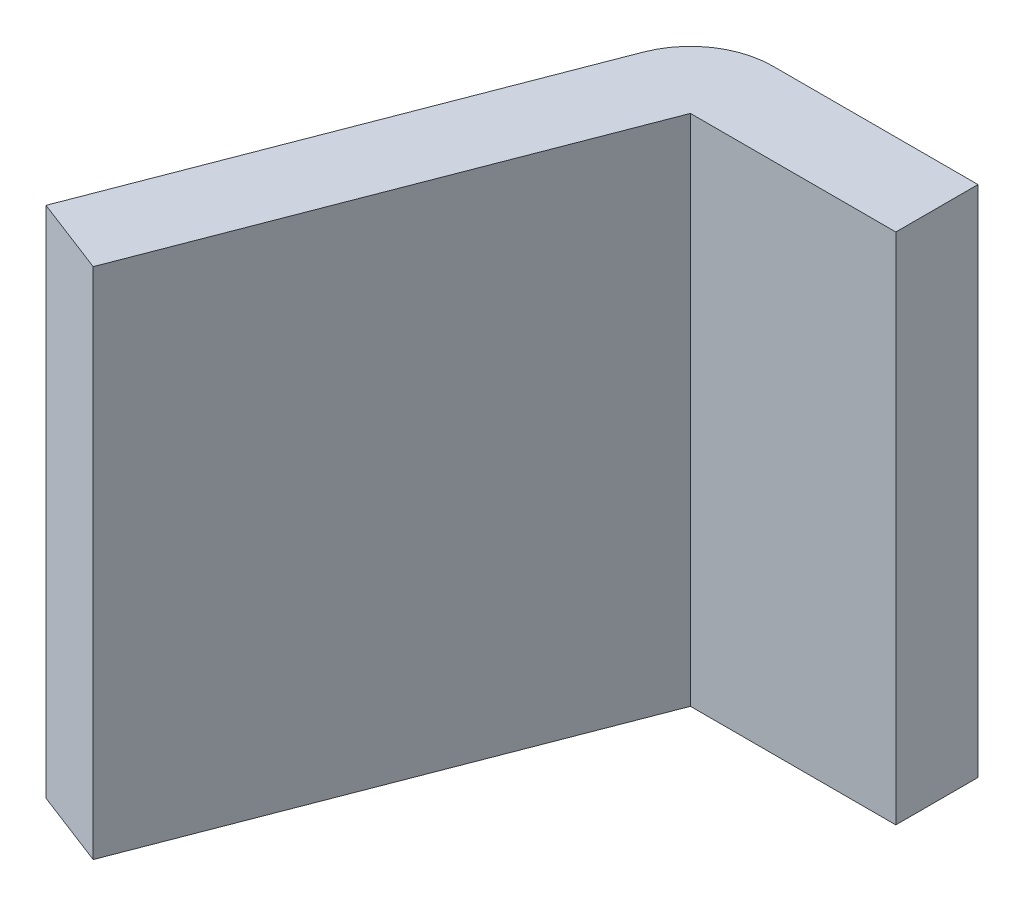
ISO-10303-21;
HEADER;
FILE_DESCRIPTION(('STEP AP214'),'2;1');
FILE_NAME('part.step','',(''),(''),'','','');
FILE_SCHEMA(('AUTOMOTIVE_DESIGN { 1 0 10303 214 1 1 1 1 }'));
ENDSEC;
DATA;
#1=APPLICATION_CONTEXT('core data for automotive mechanical design processes');
#2=APPLICATION_PROTOCOL_DEFINITION('international standard','automotive_design',2000,#1);
#3=PRODUCT_CONTEXT('',#1,'mechanical');
#4=PRODUCT('Part','Part','',(#3));
#5=PRODUCT_RELATED_PRODUCT_CATEGORY('part','',(#4));
#6=PRODUCT_DEFINITION_FORMATION('','',#4);
#7=PRODUCT_DEFINITION_CONTEXT('part definition',#1,'design');
#8=PRODUCT_DEFINITION('design','',#6,#7);
#9=PRODUCT_DEFINITION_SHAPE('','',#8);
#10=(LENGTH_UNIT() NAMED_UNIT(*) SI_UNIT(.MILLI.,.METRE.));
#11=(NAMED_UNIT(*) PLANE_ANGLE_UNIT() SI_UNIT($,.RADIAN.));
#12=(NAMED_UNIT(*) SI_UNIT($,.STERADIAN.) SOLID_ANGLE_UNIT());
#13=UNCERTAINTY_MEASURE_WITH_UNIT(LENGTH_MEASURE(1.E-05),#10,'distance_accuracy_value','');
#14=(GEOMETRIC_REPRESENTATION_CONTEXT(3) GLOBAL_UNCERTAINTY_ASSIGNED_CONTEXT((#13)) GLOBAL_UNIT_ASSIGNED_CONTEXT((#10,
#11,#12)) REPRESENTATION_CONTEXT('',''));
#15=CARTESIAN_POINT('',(0.,0.,0.));
#16=DIRECTION('',(0.,0.,1.));
#17=DIRECTION('',(1.,0.,0.));
#18=AXIS2_PLACEMENT_3D('',#15,#16,#17);
#19=CARTESIAN_POINT('',(-1.8,0.5,0.));
#20=DIRECTION('',(1.,0.,0.));
#21=DIRECTION('',(0.,0.,-1.));
#22=AXIS2_PLACEMENT_3D('',#19,#20,#21);
#23=PLANE('',#22);
#24=DIRECTION('',(0.,0.,-1.));
#25=VECTOR('',#24,1.);
#26=CARTESIAN_POINT('',(-1.8,0.5,0.0800000000000071));
#27=LINE('',#26,#25);
#28=CARTESIAN_POINT('',(-1.8,0.5,0.));
#29=VERTEX_POINT('',#28);
#30=CARTESIAN_POINT('',(-1.8,0.5,0.0800000000000071));
#31=VERTEX_POINT('',#30);
#32=EDGE_CURVE('E82',#29,#31,#27,.F.);
#33=ORIENTED_EDGE('',*,*,#32,.T.);
#34=DIRECTION('',(0.,1.,0.));
#35=VECTOR('',#34,1.);
#36=CARTESIAN_POINT('',(-1.8,0.5,0.0800000000000071));
#37=LINE('',#36,#35);
#38=CARTESIAN_POINT('',(-1.8,0.,0.0800000000000071));
#39=VERTEX_POINT('',#38);
#40=EDGE_CURVE('E85',#39,#31,#37,.T.);
#41=ORIENTED_EDGE('',*,*,#40,.F.);
#42=DIRECTION('',(0.,0.,-1.));
#43=VECTOR('',#42,1.);
#44=CARTESIAN_POINT('',(-1.8,0.,0.0800000000000071));
#45=LINE('',#44,#43);
#46=CARTESIAN_POINT('',(-1.8,0.,0.));
#47=VERTEX_POINT('',#46);
#48=EDGE_CURVE('E124',#47,#39,#45,.F.);
#49=ORIENTED_EDGE('',*,*,#48,.F.);
#50=DIRECTION('',(0.,1.,0.));
#51=VECTOR('',#50,1.);
#52=CARTESIAN_POINT('',(-1.8,0.5,0.));
#53=LINE('',#52,#51);
#54=EDGE_CURVE('E87',#29,#47,#53,.F.);
#55=ORIENTED_EDGE('',*,*,#54,.F.);
#56=EDGE_LOOP('',(#33,#41,#49,#55));
#57=FACE_BOUND('',#56,.T.);
#58=ADVANCED_FACE('F16',(#57),#23,.T.);
#59=CARTESIAN_POINT('',(-1.8,0.5,0.0800000000000071));
#60=DIRECTION('',(0.,0.,1.));
#61=DIRECTION('',(1.,0.,0.));
#62=AXIS2_PLACEMENT_3D('',#59,#60,#61);
#63=PLANE('',#62);
#64=DIRECTION('',(1.,0.,0.));
#65=VECTOR('',#64,1.);
#66=CARTESIAN_POINT('',(-2.,0.5,0.0800000000000071));
#67=LINE('',#66,#65);
#68=CARTESIAN_POINT('',(-2.00000000000041,0.5,0.0800000000000071));
#69=VERTEX_POINT('',#68);
#70=EDGE_CURVE('E90',#31,#69,#67,.F.);
#71=ORIENTED_EDGE('',*,*,#70,.T.);
#72=DIRECTION('',(0.,1.,0.));
#73=VECTOR('',#72,1.);
#74=CARTESIAN_POINT('',(-2.00000000000041,0.5,0.0800000000000071));
#75=LINE('',#74,#73);
#76=CARTESIAN_POINT('',(-2.00000000000041,0.,0.0800000000000071));
#77=VERTEX_POINT('',#76);
#78=EDGE_CURVE('E98',#77,#69,#75,.T.);
#79=ORIENTED_EDGE('',*,*,#78,.F.);
#80=DIRECTION('',(1.,0.,0.));
#81=VECTOR('',#80,1.);
#82=CARTESIAN_POINT('',(-2.,0.,0.0800000000000071));
#83=LINE('',#82,#81);
#84=EDGE_CURVE('E96',#39,#77,#83,.F.);
#85=ORIENTED_EDGE('',*,*,#84,.F.);
#86=ORIENTED_EDGE('',*,*,#40,.T.);
#87=EDGE_LOOP('',(#71,#79,#85,#86));
#88=FACE_BOUND('',#87,.T.);
#89=ADVANCED_FACE('F94',(#88),#63,.T.);
#90=CARTESIAN_POINT('',(-2.00000000000041,0.5,0.0800000000000071));
#91=DIRECTION('',(0.933333333347552,0.,0.359010987105336));
#92=DIRECTION('',(0.359010987105336,0.,-0.933333333347552));
#93=AXIS2_PLACEMENT_3D('',#90,#91,#92);
#94=PLANE('',#93);
#95=DIRECTION('',(-0.359010987105336,0.,0.933333333347552));
#96=VECTOR('',#95,1.);
#97=CARTESIAN_POINT('',(-2.00000000000041,0.5,0.0800000000000071));
#98=LINE('',#97,#96);
#99=CARTESIAN_POINT('',(-2.16155494419535,0.5,0.500000000000007));
#100=VERTEX_POINT('',#99);
#101=EDGE_CURVE('E60',#69,#100,#98,.T.);
#102=ORIENTED_EDGE('',*,*,#101,.T.);
#103=DIRECTION('',(0.,1.,0.));
#104=VECTOR('',#103,1.);
#105=CARTESIAN_POINT('',(-2.16155494419535,0.5,0.500000000000007));
#106=LINE('',#105,#104);
#107=CARTESIAN_POINT('',(-2.16155494419535,0.,0.500000000000007));
#108=VERTEX_POINT('',#107);
#109=EDGE_CURVE('E151',#108,#100,#106,.T.);
#110=ORIENTED_EDGE('',*,*,#109,.F.);
#111=DIRECTION('',(-0.359010987105336,0.,0.933333333347552));
#112=VECTOR('',#111,1.);
#113=CARTESIAN_POINT('',(-2.00000000000041,0.,0.0800000000000071));
#114=LINE('',#113,#112);
#115=EDGE_CURVE('E118',#77,#108,#114,.T.);
#116=ORIENTED_EDGE('',*,*,#115,.F.);
#117=ORIENTED_EDGE('',*,*,#78,.T.);
#118=EDGE_LOOP('',(#102,#110,#116,#117));
#119=FACE_BOUND('',#118,.T.);
#120=ADVANCED_FACE('F166',(#119),#94,.T.);
#121=CARTESIAN_POINT('',(-2.,0.5,0.));
#122=DIRECTION('',(0.,0.,-1.));
#123=DIRECTION('',(-1.,0.,0.));
#124=AXIS2_PLACEMENT_3D('',#121,#122,#123);
#125=PLANE('',#124);
#126=DIRECTION('',(1.,0.,0.));
#127=VECTOR('',#126,1.);
#128=CARTESIAN_POINT('',(-2.,0.5,0.));
#129=LINE('',#128,#127);
#130=CARTESIAN_POINT('',(-2.,0.5,0.));
#131=VERTEX_POINT('',#130);
#132=EDGE_CURVE('E91',#131,#29,#129,.T.);
#133=ORIENTED_EDGE('',*,*,#132,.T.);
#134=ORIENTED_EDGE('',*,*,#54,.T.);
#135=DIRECTION('',(1.,0.,0.));
#136=VECTOR('',#135,1.);
#137=CARTESIAN_POINT('',(-2.,0.,0.));
#138=LINE('',#137,#136);
#139=CARTESIAN_POINT('',(-2.,0.,0.));
#140=VERTEX_POINT('',#139);
#141=EDGE_CURVE('E51',#140,#47,#138,.T.);
#142=ORIENTED_EDGE('',*,*,#141,.F.);
#143=DIRECTION('',(0.,1.,0.));
#144=VECTOR('',#143,1.);
#145=CARTESIAN_POINT('',(-2.,0.5,0.));
#146=LINE('',#145,#144);
#147=EDGE_CURVE('E129',#131,#140,#146,.F.);
#148=ORIENTED_EDGE('',*,*,#147,.F.);
#149=EDGE_LOOP('',(#133,#134,#142,#148));
#150=FACE_BOUND('',#149,.T.);
#151=ADVANCED_FACE('F171',(#150),#125,.T.);
#152=CARTESIAN_POINT('',(-2.,0.,0.0800000000000071));
#153=DIRECTION('',(0.,-1.,0.));
#154=DIRECTION('',(0.,0.,-1.));
#155=AXIS2_PLACEMENT_3D('',#152,#153,#154);
#156=PLANE('',#155);
#157=DIRECTION('',(0.933333333347547,0.,0.359010987105349));
#158=VECTOR('',#157,1.);
#159=CARTESIAN_POINT('',(-2.16155494419535,0.,0.500000000000007));
#160=LINE('',#159,#158);
#161=CARTESIAN_POINT('',(-2.23622161086346,0.,0.471279121031461));
#162=VERTEX_POINT('',#161);
#163=EDGE_CURVE('E120',#162,#108,#160,.T.);
#164=ORIENTED_EDGE('',*,*,#163,.F.);
#165=DIRECTION('',(-0.359010987105348,0.,0.933333333347547));
#166=VECTOR('',#165,1.);
#167=CARTESIAN_POINT('',(-2.23622161086346,0.,0.471279121031461));
#168=LINE('',#167,#166);
#169=CARTESIAN_POINT('',(-2.07466666666849,0.,0.0512791210313932));
#170=VERTEX_POINT('',#169);
#171=EDGE_CURVE('E132',#170,#162,#168,.T.);
#172=ORIENTED_EDGE('',*,*,#171,.F.);
#173=CARTESIAN_POINT('',(-2.,0.,0.0800000000000071));
#174=DIRECTION('',(0.,1.,0.));
#175=DIRECTION('',(0.,0.,1.));
#176=AXIS2_PLACEMENT_3D('',#173,#174,#175);
#177=CIRCLE('',#176,0.0800000000000071);
#178=EDGE_CURVE('E19',#140,#170,#177,.T.);
#179=ORIENTED_EDGE('',*,*,#178,.F.);
#180=ORIENTED_EDGE('',*,*,#141,.T.);
#181=ORIENTED_EDGE('',*,*,#48,.T.);
#182=ORIENTED_EDGE('',*,*,#84,.T.);
#183=ORIENTED_EDGE('',*,*,#115,.T.);
#184=EDGE_LOOP('',(#164,#172,#179,#180,#181,#182,#183));
#185=FACE_BOUND('',#184,.T.);
#186=ADVANCED_FACE('F168',(#185),#156,.T.);
#187=CARTESIAN_POINT('',(-2.16155494419535,0.5,0.500000000000007));
#188=DIRECTION('',(-0.359010987105349,0.,0.933333333347547));
#189=DIRECTION('',(0.933333333347547,0.,0.359010987105349));
#190=AXIS2_PLACEMENT_3D('',#187,#188,#189);
#191=PLANE('',#190);
#192=DIRECTION('',(-0.933333333347545,0.,-0.359010987105353));
#193=VECTOR('',#192,1.);
#194=CARTESIAN_POINT('',(-2.16155494419535,0.5,0.500000000000007));
#195=LINE('',#194,#193);
#196=CARTESIAN_POINT('',(-2.23622161086346,0.5,0.471279121031461));
#197=VERTEX_POINT('',#196);
#198=EDGE_CURVE('E103',#100,#197,#195,.T.);
#199=ORIENTED_EDGE('',*,*,#198,.T.);
#200=DIRECTION('',(0.,1.,0.));
#201=VECTOR('',#200,1.);
#202=CARTESIAN_POINT('',(-2.23622161086346,0.5,0.471279121031461));
#203=LINE('',#202,#201);
#204=EDGE_CURVE('E144',#162,#197,#203,.T.);
#205=ORIENTED_EDGE('',*,*,#204,.F.);
#206=ORIENTED_EDGE('',*,*,#163,.T.);
#207=ORIENTED_EDGE('',*,*,#109,.T.);
#208=EDGE_LOOP('',(#199,#205,#206,#207));
#209=FACE_BOUND('',#208,.T.);
#210=ADVANCED_FACE('F178',(#209),#191,.T.);
#211=CARTESIAN_POINT('',(-2.,0.5,0.0800000000000071));
#212=DIRECTION('',(0.,-1.,0.));
#213=DIRECTION('',(0.,0.,-1.));
#214=AXIS2_PLACEMENT_3D('',#211,#212,#213);
#215=PLANE('',#214);
#216=DIRECTION('',(-0.359010987105348,0.,0.933333333347547));
#217=VECTOR('',#216,1.);
#218=CARTESIAN_POINT('',(-2.23622161086346,0.5,0.471279121031461));
#219=LINE('',#218,#217);
#220=CARTESIAN_POINT('',(-2.07466666666849,0.5,0.0512791210313932));
#221=VERTEX_POINT('',#220);
#222=EDGE_CURVE('E25',#197,#221,#219,.F.);
#223=ORIENTED_EDGE('',*,*,#222,.F.);
#224=ORIENTED_EDGE('',*,*,#198,.F.);
#225=ORIENTED_EDGE('',*,*,#101,.F.);
#226=ORIENTED_EDGE('',*,*,#70,.F.);
#227=ORIENTED_EDGE('',*,*,#32,.F.);
#228=ORIENTED_EDGE('',*,*,#132,.F.);
#229=CARTESIAN_POINT('',(-2.,0.5,0.0800000000000071));
#230=DIRECTION('',(0.,1.,0.));
#231=DIRECTION('',(0.,0.,1.));
#232=AXIS2_PLACEMENT_3D('',#229,#230,#231);
#233=CIRCLE('',#232,0.0800000000000071);
#234=EDGE_CURVE('E34',#221,#131,#233,.F.);
#235=ORIENTED_EDGE('',*,*,#234,.F.);
#236=EDGE_LOOP('',(#223,#224,#225,#226,#227,#228,#235));
#237=FACE_BOUND('',#236,.T.);
#238=ADVANCED_FACE('F100',(#237),#215,.F.);
#239=CARTESIAN_POINT('',(-2.,0.5,0.0800000000000071));
#240=DIRECTION('',(0.,1.,0.));
#241=DIRECTION('',(0.,0.,1.));
#242=AXIS2_PLACEMENT_3D('',#239,#240,#241);
#243=CYLINDRICAL_SURFACE('',#242,0.0800000000000071);
#244=ORIENTED_EDGE('',*,*,#234,.T.);
#245=ORIENTED_EDGE('',*,*,#147,.T.);
#246=ORIENTED_EDGE('',*,*,#178,.T.);
#247=DIRECTION('',(0.,1.,0.));
#248=VECTOR('',#247,1.);
#249=CARTESIAN_POINT('',(-2.07466666666851,0.5,0.0512791210314601));
#250=LINE('',#249,#248);
#251=EDGE_CURVE('E11',#221,#170,#250,.F.);
#252=ORIENTED_EDGE('',*,*,#251,.F.);
#253=EDGE_LOOP('',(#244,#245,#246,#252));
#254=FACE_BOUND('',#253,.T.);
#255=ADVANCED_FACE('F170',(#254),#243,.T.);
#256=CARTESIAN_POINT('',(-2.23622161086346,0.5,0.471279121031461));
#257=DIRECTION('',(-0.933333333347547,0.,-0.359010987105348));
#258=DIRECTION('',(-0.359010987105348,0.,0.933333333347547));
#259=AXIS2_PLACEMENT_3D('',#256,#257,#258);
#260=PLANE('',#259);
#261=ORIENTED_EDGE('',*,*,#222,.T.);
#262=ORIENTED_EDGE('',*,*,#251,.T.);
#263=ORIENTED_EDGE('',*,*,#171,.T.);
#264=ORIENTED_EDGE('',*,*,#204,.T.);
#265=EDGE_LOOP('',(#261,#262,#263,#264));
#266=FACE_BOUND('',#265,.T.);
#267=ADVANCED_FACE('F177',(#266),#260,.T.);
#268=CLOSED_SHELL('',(#58,#89,#120,#151,#186,#210,#238,#255,#267));
#269=MANIFOLD_SOLID_BREP('B1',#268);
#270=ADVANCED_BREP_SHAPE_REPRESENTATION('',(#18,#269),#14);
#271=SHAPE_DEFINITION_REPRESENTATION(#9,#270);
ENDSEC;
END-ISO-10303-21;
